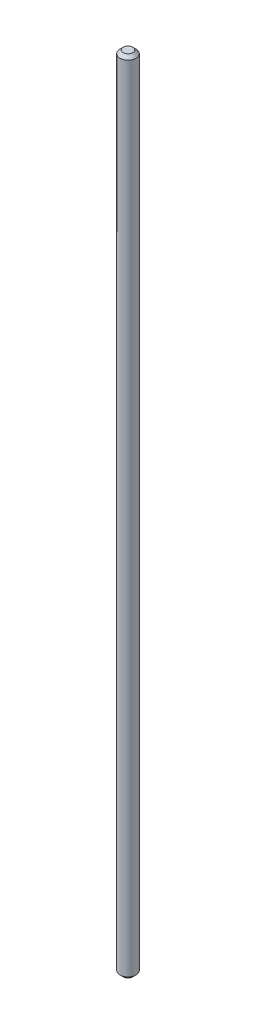
ISO-10303-21;
HEADER;
FILE_DESCRIPTION(('STEP AP214'),'2;1');
FILE_NAME('part.step','',(''),(''),'','','');
FILE_SCHEMA(('AUTOMOTIVE_DESIGN { 1 0 10303 214 1 1 1 1 }'));
ENDSEC;
DATA;
#1=APPLICATION_CONTEXT('core data for automotive mechanical design processes');
#2=APPLICATION_PROTOCOL_DEFINITION('international standard','automotive_design',2000,#1);
#3=PRODUCT_CONTEXT('',#1,'mechanical');
#4=PRODUCT('Part','Part','',(#3));
#5=PRODUCT_RELATED_PRODUCT_CATEGORY('part','',(#4));
#6=PRODUCT_DEFINITION_FORMATION('','',#4);
#7=PRODUCT_DEFINITION_CONTEXT('part definition',#1,'design');
#8=PRODUCT_DEFINITION('design','',#6,#7);
#9=PRODUCT_DEFINITION_SHAPE('','',#8);
#10=(LENGTH_UNIT() NAMED_UNIT(*) SI_UNIT(.MILLI.,.METRE.));
#11=(NAMED_UNIT(*) PLANE_ANGLE_UNIT() SI_UNIT($,.RADIAN.));
#12=(NAMED_UNIT(*) SI_UNIT($,.STERADIAN.) SOLID_ANGLE_UNIT());
#13=UNCERTAINTY_MEASURE_WITH_UNIT(LENGTH_MEASURE(1.E-05),#10,'distance_accuracy_value','');
#14=(GEOMETRIC_REPRESENTATION_CONTEXT(3) GLOBAL_UNCERTAINTY_ASSIGNED_CONTEXT((#13)) GLOBAL_UNIT_ASSIGNED_CONTEXT((#10,
#11,#12)) REPRESENTATION_CONTEXT('',''));
#15=CARTESIAN_POINT('',(0.,0.,0.));
#16=DIRECTION('',(0.,0.,1.));
#17=DIRECTION('',(1.,0.,0.));
#18=AXIS2_PLACEMENT_3D('',#15,#16,#17);
#19=CARTESIAN_POINT('',(0.,250.,0.));
#20=DIRECTION('',(0.,-1.,0.));
#21=DIRECTION('',(0.,0.,-1.));
#22=AXIS2_PLACEMENT_3D('',#19,#20,#21);
#23=CYLINDRICAL_SURFACE('',#22,2.5);
#24=CARTESIAN_POINT('',(0.,1.,0.));
#25=DIRECTION('',(0.,1.,0.));
#26=DIRECTION('',(0.,0.,1.));
#27=AXIS2_PLACEMENT_3D('',#24,#25,#26);
#28=CIRCLE('',#27,2.5);
#29=CARTESIAN_POINT('',(0.,1.,2.5));
#30=VERTEX_POINT('',#29);
#31=EDGE_CURVE('E49',#30,#30,#28,.T.);
#32=ORIENTED_EDGE('',*,*,#31,.T.);
#33=EDGE_LOOP('',(#32));
#34=FACE_BOUND('',#33,.T.);
#35=CARTESIAN_POINT('',(0.,249.,0.));
#36=DIRECTION('',(0.,1.,0.));
#37=DIRECTION('',(0.,0.,1.));
#38=AXIS2_PLACEMENT_3D('',#35,#36,#37);
#39=CIRCLE('',#38,2.5);
#40=CARTESIAN_POINT('',(0.,249.,2.5));
#41=VERTEX_POINT('',#40);
#42=EDGE_CURVE('E53',#41,#41,#39,.F.);
#43=ORIENTED_EDGE('',*,*,#42,.T.);
#44=EDGE_LOOP('',(#43));
#45=FACE_BOUND('',#44,.T.);
#46=ADVANCED_FACE('F37',(#34,#45),#23,.T.);
#47=CARTESIAN_POINT('',(0.,250.,0.));
#48=DIRECTION('',(0.,1.,0.));
#49=DIRECTION('',(0.,0.,1.));
#50=AXIS2_PLACEMENT_3D('',#47,#48,#49);
#51=PLANE('',#50);
#52=CARTESIAN_POINT('',(0.,250.,0.));
#53=DIRECTION('',(0.,1.,0.));
#54=DIRECTION('',(0.,0.,1.));
#55=AXIS2_PLACEMENT_3D('',#52,#53,#54);
#56=CIRCLE('',#55,1.5);
#57=CARTESIAN_POINT('',(0.,250.,1.5));
#58=VERTEX_POINT('',#57);
#59=EDGE_CURVE('E10',#58,#58,#56,.T.);
#60=ORIENTED_EDGE('',*,*,#59,.T.);
#61=EDGE_LOOP('',(#60));
#62=FACE_BOUND('',#61,.T.);
#63=ADVANCED_FACE('F69',(#62),#51,.T.);
#64=CARTESIAN_POINT('',(0.,0.,0.));
#65=DIRECTION('',(0.,1.,0.));
#66=DIRECTION('',(0.,0.,1.));
#67=AXIS2_PLACEMENT_3D('',#64,#65,#66);
#68=PLANE('',#67);
#69=CARTESIAN_POINT('',(0.,0.,0.));
#70=DIRECTION('',(0.,1.,0.));
#71=DIRECTION('',(0.,0.,1.));
#72=AXIS2_PLACEMENT_3D('',#69,#70,#71);
#73=CIRCLE('',#72,1.50000000000003);
#74=CARTESIAN_POINT('',(0.,0.,1.50000000000003));
#75=VERTEX_POINT('',#74);
#76=EDGE_CURVE('E45',#75,#75,#73,.F.);
#77=ORIENTED_EDGE('',*,*,#76,.T.);
#78=EDGE_LOOP('',(#77));
#79=FACE_BOUND('',#78,.T.);
#80=ADVANCED_FACE('F66',(#79),#68,.F.);
#81=CARTESIAN_POINT('',(0.,1.,0.));
#82=DIRECTION('',(0.,1.,0.));
#83=DIRECTION('',(0.,0.,1.));
#84=AXIS2_PLACEMENT_3D('',#81,#82,#83);
#85=CONICAL_SURFACE('',#84,2.5,0.785398163397433);
#86=ORIENTED_EDGE('',*,*,#76,.F.);
#87=EDGE_LOOP('',(#86));
#88=FACE_BOUND('',#87,.T.);
#89=ORIENTED_EDGE('',*,*,#31,.F.);
#90=EDGE_LOOP('',(#89));
#91=FACE_BOUND('',#90,.T.);
#92=ADVANCED_FACE('F62',(#88,#91),#85,.T.);
#93=CARTESIAN_POINT('',(0.,250.,0.));
#94=DIRECTION('',(0.,-1.,0.));
#95=DIRECTION('',(0.,0.,-1.));
#96=AXIS2_PLACEMENT_3D('',#93,#94,#95);
#97=CONICAL_SURFACE('',#96,1.5,0.785398163397475);
#98=ORIENTED_EDGE('',*,*,#42,.F.);
#99=EDGE_LOOP('',(#98));
#100=FACE_BOUND('',#99,.T.);
#101=ORIENTED_EDGE('',*,*,#59,.F.);
#102=EDGE_LOOP('',(#101));
#103=FACE_BOUND('',#102,.T.);
#104=ADVANCED_FACE('F40',(#100,#103),#97,.T.);
#105=CLOSED_SHELL('',(#46,#63,#80,#92,#104));
#106=MANIFOLD_SOLID_BREP('B2',#105);
#107=ADVANCED_BREP_SHAPE_REPRESENTATION('',(#18,#106),#14);
#108=SHAPE_DEFINITION_REPRESENTATION(#9,#107);
ENDSEC;
END-ISO-10303-21;
